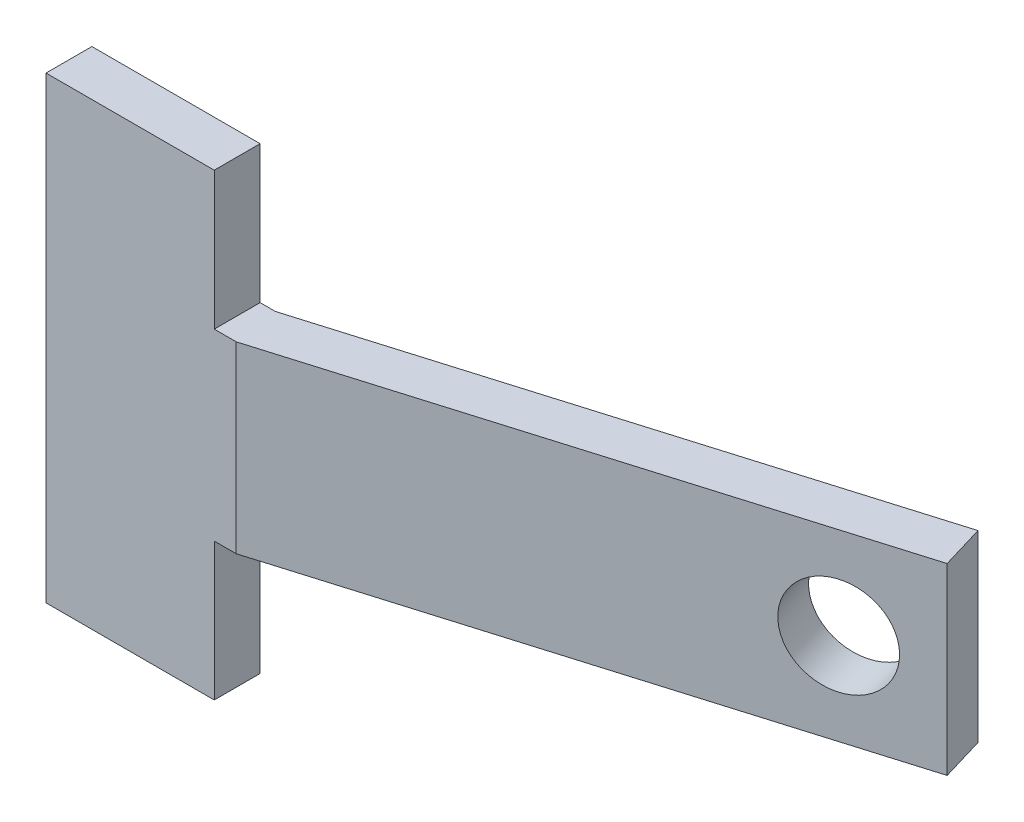
ISO-10303-21;
HEADER;
FILE_DESCRIPTION(('STEP AP214'),'2;1');
FILE_NAME('part.step','',(''),(''),'','','');
FILE_SCHEMA(('AUTOMOTIVE_DESIGN { 1 0 10303 214 1 1 1 1 }'));
ENDSEC;
DATA;
#1=APPLICATION_CONTEXT('core data for automotive mechanical design processes');
#2=APPLICATION_PROTOCOL_DEFINITION('international standard','automotive_design',2000,#1);
#3=PRODUCT_CONTEXT('',#1,'mechanical');
#4=PRODUCT('Part','Part','',(#3));
#5=PRODUCT_RELATED_PRODUCT_CATEGORY('part','',(#4));
#6=PRODUCT_DEFINITION_FORMATION('','',#4);
#7=PRODUCT_DEFINITION_CONTEXT('part definition',#1,'design');
#8=PRODUCT_DEFINITION('design','',#6,#7);
#9=PRODUCT_DEFINITION_SHAPE('','',#8);
#10=(LENGTH_UNIT() NAMED_UNIT(*) SI_UNIT(.MILLI.,.METRE.));
#11=(NAMED_UNIT(*) PLANE_ANGLE_UNIT() SI_UNIT($,.RADIAN.));
#12=(NAMED_UNIT(*) SI_UNIT($,.STERADIAN.) SOLID_ANGLE_UNIT());
#13=UNCERTAINTY_MEASURE_WITH_UNIT(LENGTH_MEASURE(1.E-05),#10,'distance_accuracy_value','');
#14=(GEOMETRIC_REPRESENTATION_CONTEXT(3) GLOBAL_UNCERTAINTY_ASSIGNED_CONTEXT((#13)) GLOBAL_UNIT_ASSIGNED_CONTEXT((#10,
#11,#12)) REPRESENTATION_CONTEXT('',''));
#15=CARTESIAN_POINT('',(0.,0.,0.));
#16=DIRECTION('',(0.,0.,1.));
#17=DIRECTION('',(1.,0.,0.));
#18=AXIS2_PLACEMENT_3D('',#15,#16,#17);
#19=CARTESIAN_POINT('',(-45.1372802270666,6.,45.84));
#20=DIRECTION('',(0.,0.,1.));
#21=DIRECTION('',(1.,0.,0.));
#22=AXIS2_PLACEMENT_3D('',#19,#20,#21);
#23=PLANE('',#22);
#24=DIRECTION('',(-1.,0.,0.));
#25=VECTOR('',#24,1.);
#26=CARTESIAN_POINT('',(-45.1372802270666,0.,45.84));
#27=LINE('',#26,#25);
#28=CARTESIAN_POINT('',(-39.1372802270666,0.,45.84));
#29=VERTEX_POINT('',#28);
#30=CARTESIAN_POINT('',(-39.6372802270666,0.,45.84));
#31=VERTEX_POINT('',#30);
#32=EDGE_CURVE('E179',#29,#31,#27,.T.);
#33=ORIENTED_EDGE('',*,*,#32,.T.);
#34=DIRECTION('',(0.,-1.,0.));
#35=VECTOR('',#34,1.);
#36=CARTESIAN_POINT('',(-39.6372802270666,10.5,45.84));
#37=LINE('',#36,#35);
#38=CARTESIAN_POINT('',(-39.6372802270666,-4.5,45.84));
#39=VERTEX_POINT('',#38);
#40=EDGE_CURVE('E157',#31,#39,#37,.T.);
#41=ORIENTED_EDGE('',*,*,#40,.T.);
#42=DIRECTION('',(-1.,0.,0.));
#43=VECTOR('',#42,1.);
#44=CARTESIAN_POINT('',(-45.1372802270666,-4.5,45.84));
#45=LINE('',#44,#43);
#46=CARTESIAN_POINT('',(-45.1372802270666,-4.5,45.84));
#47=VERTEX_POINT('',#46);
#48=EDGE_CURVE('E143',#39,#47,#45,.T.);
#49=ORIENTED_EDGE('',*,*,#48,.T.);
#50=DIRECTION('',(0.,-1.,0.));
#51=VECTOR('',#50,1.);
#52=CARTESIAN_POINT('',(-45.1372802270666,6.,45.84));
#53=LINE('',#52,#51);
#54=CARTESIAN_POINT('',(-45.1372802270666,10.5,45.84));
#55=VERTEX_POINT('',#54);
#56=EDGE_CURVE('E47',#55,#47,#53,.T.);
#57=ORIENTED_EDGE('',*,*,#56,.F.);
#58=DIRECTION('',(1.,0.,0.));
#59=VECTOR('',#58,1.);
#60=CARTESIAN_POINT('',(-45.1372802270666,10.5,45.84));
#61=LINE('',#60,#59);
#62=CARTESIAN_POINT('',(-39.6372802270666,10.5,45.84));
#63=VERTEX_POINT('',#62);
#64=EDGE_CURVE('E132',#55,#63,#61,.T.);
#65=ORIENTED_EDGE('',*,*,#64,.T.);
#66=CARTESIAN_POINT('',(-39.6372802270666,6.,45.84));
#67=VERTEX_POINT('',#66);
#68=EDGE_CURVE('E149',#63,#67,#37,.T.);
#69=ORIENTED_EDGE('',*,*,#68,.T.);
#70=DIRECTION('',(-1.,0.,0.));
#71=VECTOR('',#70,1.);
#72=CARTESIAN_POINT('',(-45.1372802270666,6.,45.84));
#73=LINE('',#72,#71);
#74=CARTESIAN_POINT('',(-39.1372802270666,6.,45.84));
#75=VERTEX_POINT('',#74);
#76=EDGE_CURVE('E59',#75,#67,#73,.T.);
#77=ORIENTED_EDGE('',*,*,#76,.F.);
#78=DIRECTION('',(0.,-1.,0.));
#79=VECTOR('',#78,1.);
#80=CARTESIAN_POINT('',(-39.1372802270666,6.,45.84));
#81=LINE('',#80,#79);
#82=EDGE_CURVE('E195',#75,#29,#81,.T.);
#83=ORIENTED_EDGE('',*,*,#82,.T.);
#84=EDGE_LOOP('',(#33,#41,#49,#57,#65,#69,#77,#83));
#85=FACE_BOUND('',#84,.T.);
#86=ADVANCED_FACE('F39',(#85),#23,.F.);
#87=CARTESIAN_POINT('',(-45.1372802270666,6.,45.84));
#88=DIRECTION('',(1.,0.,0.));
#89=DIRECTION('',(0.,0.,-1.));
#90=AXIS2_PLACEMENT_3D('',#87,#88,#89);
#91=PLANE('',#90);
#92=ORIENTED_EDGE('',*,*,#56,.T.);
#93=DIRECTION('',(0.,0.,-1.));
#94=VECTOR('',#93,1.);
#95=CARTESIAN_POINT('',(-45.1372802270666,-4.5,47.34));
#96=LINE('',#95,#94);
#97=CARTESIAN_POINT('',(-45.1372802270666,-4.5,47.34));
#98=VERTEX_POINT('',#97);
#99=EDGE_CURVE('E119',#98,#47,#96,.T.);
#100=ORIENTED_EDGE('',*,*,#99,.F.);
#101=DIRECTION('',(0.,-1.,0.));
#102=VECTOR('',#101,1.);
#103=CARTESIAN_POINT('',(-45.1372802270666,6.,47.34));
#104=LINE('',#103,#102);
#105=CARTESIAN_POINT('',(-45.1372802270666,10.5,47.34));
#106=VERTEX_POINT('',#105);
#107=EDGE_CURVE('E113',#106,#98,#104,.T.);
#108=ORIENTED_EDGE('',*,*,#107,.F.);
#109=DIRECTION('',(0.,0.,-1.));
#110=VECTOR('',#109,1.);
#111=CARTESIAN_POINT('',(-45.1372802270666,10.5,47.34));
#112=LINE('',#111,#110);
#113=EDGE_CURVE('E116',#106,#55,#112,.T.);
#114=ORIENTED_EDGE('',*,*,#113,.T.);
#115=EDGE_LOOP('',(#92,#100,#108,#114));
#116=FACE_BOUND('',#115,.T.);
#117=ADVANCED_FACE('F115',(#116),#91,.F.);
#118=CARTESIAN_POINT('',(-45.1372802270666,6.,47.34));
#119=DIRECTION('',(0.,0.,-1.));
#120=DIRECTION('',(-1.,0.,0.));
#121=AXIS2_PLACEMENT_3D('',#118,#119,#120);
#122=PLANE('',#121);
#123=DIRECTION('',(1.,0.,0.));
#124=VECTOR('',#123,1.);
#125=CARTESIAN_POINT('',(-45.1372802270666,6.,47.34));
#126=LINE('',#125,#124);
#127=CARTESIAN_POINT('',(-39.6372802270666,6.,47.34));
#128=VERTEX_POINT('',#127);
#129=CARTESIAN_POINT('',(-38.9181414665424,6.,47.34));
#130=VERTEX_POINT('',#129);
#131=EDGE_CURVE('E182',#128,#130,#126,.T.);
#132=ORIENTED_EDGE('',*,*,#131,.F.);
#133=DIRECTION('',(0.,-1.,0.));
#134=VECTOR('',#133,1.);
#135=CARTESIAN_POINT('',(-39.6372802270666,10.5,47.34));
#136=LINE('',#135,#134);
#137=CARTESIAN_POINT('',(-39.6372802270666,10.5,47.34));
#138=VERTEX_POINT('',#137);
#139=EDGE_CURVE('E140',#138,#128,#136,.T.);
#140=ORIENTED_EDGE('',*,*,#139,.F.);
#141=DIRECTION('',(1.,0.,0.));
#142=VECTOR('',#141,1.);
#143=CARTESIAN_POINT('',(-45.1372802270666,10.5,47.34));
#144=LINE('',#143,#142);
#145=EDGE_CURVE('E130',#106,#138,#144,.T.);
#146=ORIENTED_EDGE('',*,*,#145,.F.);
#147=ORIENTED_EDGE('',*,*,#107,.T.);
#148=DIRECTION('',(-1.,0.,0.));
#149=VECTOR('',#148,1.);
#150=CARTESIAN_POINT('',(-45.1372802270666,-4.5,47.34));
#151=LINE('',#150,#149);
#152=CARTESIAN_POINT('',(-39.6372802270666,-4.5,47.34));
#153=VERTEX_POINT('',#152);
#154=EDGE_CURVE('E135',#153,#98,#151,.T.);
#155=ORIENTED_EDGE('',*,*,#154,.F.);
#156=CARTESIAN_POINT('',(-39.6372802270666,0.,47.34));
#157=VERTEX_POINT('',#156);
#158=EDGE_CURVE('E142',#157,#153,#136,.T.);
#159=ORIENTED_EDGE('',*,*,#158,.F.);
#160=DIRECTION('',(1.,0.,0.));
#161=VECTOR('',#160,1.);
#162=CARTESIAN_POINT('',(-45.1372802270666,0.,47.34));
#163=LINE('',#162,#161);
#164=CARTESIAN_POINT('',(-38.9181414665424,0.,47.34));
#165=VERTEX_POINT('',#164);
#166=EDGE_CURVE('E199',#157,#165,#163,.T.);
#167=ORIENTED_EDGE('',*,*,#166,.T.);
#168=DIRECTION('',(0.,-1.,0.));
#169=VECTOR('',#168,1.);
#170=CARTESIAN_POINT('',(-38.9181414665424,6.,47.34));
#171=LINE('',#170,#169);
#172=EDGE_CURVE('E125',#130,#165,#171,.T.);
#173=ORIENTED_EDGE('',*,*,#172,.F.);
#174=EDGE_LOOP('',(#132,#140,#146,#147,#155,#159,#167,#173));
#175=FACE_BOUND('',#174,.T.);
#176=ADVANCED_FACE('F138',(#175),#122,.F.);
#177=CARTESIAN_POINT('',(-26.4837149805438,6.,43.6276133785459));
#178=DIRECTION('',(-0.28607921935842,0.,-0.958205969638719));
#179=DIRECTION('',(-0.958205969638719,0.,0.28607921935842));
#180=AXIS2_PLACEMENT_3D('',#177,#178,#179);
#181=PLANE('',#180);
#182=CARTESIAN_POINT('',(-23.7528279670738,3.,42.8122876033743));
#183=DIRECTION('',(0.286079219358415,0.,0.95820596963872));
#184=DIRECTION('',(0.95820596963872,0.,-0.286079219358415));
#185=AXIS2_PLACEMENT_3D('',#182,#183,#184);
#186=CIRCLE('',#185,1.59999999999999);
#187=CARTESIAN_POINT('',(-22.2196984156519,3.,42.3545608524009));
#188=VERTEX_POINT('',#187);
#189=EDGE_CURVE('E171',#188,#188,#186,.T.);
#190=ORIENTED_EDGE('',*,*,#189,.F.);
#191=EDGE_LOOP('',(#190));
#192=FACE_BOUND('',#191,.T.);
#193=DIRECTION('',(0.958205969638719,0.,-0.28607921935842));
#194=VECTOR('',#193,1.);
#195=CARTESIAN_POINT('',(-26.4837149805438,0.,43.6276133785459));
#196=LINE('',#195,#194);
#197=CARTESIAN_POINT('',(-21.0219409536031,0.,41.9969618282029));
#198=VERTEX_POINT('',#197);
#199=EDGE_CURVE('E202',#165,#198,#196,.T.);
#200=ORIENTED_EDGE('',*,*,#199,.T.);
#201=DIRECTION('',(0.,-1.,0.));
#202=VECTOR('',#201,1.);
#203=CARTESIAN_POINT('',(-21.0219409536031,6.,41.9969618282029));
#204=LINE('',#203,#202);
#205=CARTESIAN_POINT('',(-21.0219409536031,6.,41.9969618282029));
#206=VERTEX_POINT('',#205);
#207=EDGE_CURVE('E218',#206,#198,#204,.T.);
#208=ORIENTED_EDGE('',*,*,#207,.F.);
#209=DIRECTION('',(0.958205969638716,0.,-0.286079219358429));
#210=VECTOR('',#209,1.);
#211=CARTESIAN_POINT('',(-38.9181414665424,6.,47.34));
#212=LINE('',#211,#210);
#213=EDGE_CURVE('E186',#130,#206,#212,.T.);
#214=ORIENTED_EDGE('',*,*,#213,.F.);
#215=ORIENTED_EDGE('',*,*,#172,.T.);
#216=EDGE_LOOP('',(#200,#208,#214,#215));
#217=FACE_BOUND('',#216,.T.);
#218=ADVANCED_FACE('F245',(#192,#217),#181,.F.);
#219=CARTESIAN_POINT('',(-21.0219409536031,6.,41.9969618282029));
#220=DIRECTION('',(-0.958205969638719,0.,0.286079219358418));
#221=DIRECTION('',(0.286079219358418,0.,0.958205969638719));
#222=AXIS2_PLACEMENT_3D('',#219,#220,#221);
#223=PLANE('',#222);
#224=DIRECTION('',(-0.286079219358418,0.,-0.958205969638719));
#225=VECTOR('',#224,1.);
#226=CARTESIAN_POINT('',(-21.0219409536031,0.,41.9969618282029));
#227=LINE('',#226,#225);
#228=CARTESIAN_POINT('',(-21.4510597826407,0.,40.5596528737448));
#229=VERTEX_POINT('',#228);
#230=EDGE_CURVE('E205',#198,#229,#227,.T.);
#231=ORIENTED_EDGE('',*,*,#230,.T.);
#232=DIRECTION('',(0.,-1.,0.));
#233=VECTOR('',#232,1.);
#234=CARTESIAN_POINT('',(-21.4510597826407,6.,40.5596528737448));
#235=LINE('',#234,#233);
#236=CARTESIAN_POINT('',(-21.4510597826407,6.,40.5596528737448));
#237=VERTEX_POINT('',#236);
#238=EDGE_CURVE('E214',#237,#229,#235,.T.);
#239=ORIENTED_EDGE('',*,*,#238,.F.);
#240=DIRECTION('',(-0.286079219358418,0.,-0.958205969638719));
#241=VECTOR('',#240,1.);
#242=CARTESIAN_POINT('',(-21.0219409536031,6.,41.9969618282029));
#243=LINE('',#242,#241);
#244=EDGE_CURVE('E189',#206,#237,#243,.T.);
#245=ORIENTED_EDGE('',*,*,#244,.F.);
#246=ORIENTED_EDGE('',*,*,#207,.T.);
#247=EDGE_LOOP('',(#231,#239,#245,#246));
#248=FACE_BOUND('',#247,.T.);
#249=ADVANCED_FACE('F254',(#248),#223,.F.);
#250=CARTESIAN_POINT('',(-27.200295600473,6.,42.2761281898953));
#251=DIRECTION('',(0.286079219358428,0.,0.958205969638716));
#252=DIRECTION('',(0.958205969638716,0.,-0.286079219358428));
#253=AXIS2_PLACEMENT_3D('',#250,#251,#252);
#254=PLANE('',#253);
#255=CARTESIAN_POINT('',(-24.1819467961114,3.,41.3749786489164));
#256=DIRECTION('',(0.286079219358428,0.,0.958205969638716));
#257=DIRECTION('',(0.958205969638716,0.,-0.286079219358428));
#258=AXIS2_PLACEMENT_3D('',#255,#256,#257);
#259=CIRCLE('',#258,1.59999999999999);
#260=CARTESIAN_POINT('',(-22.6488172446894,3.,40.9172518979429));
#261=VERTEX_POINT('',#260);
#262=EDGE_CURVE('E175',#261,#261,#259,.T.);
#263=ORIENTED_EDGE('',*,*,#262,.T.);
#264=EDGE_LOOP('',(#263));
#265=FACE_BOUND('',#264,.T.);
#266=DIRECTION('',(-0.958205969638716,0.,0.286079219358428));
#267=VECTOR('',#266,1.);
#268=CARTESIAN_POINT('',(-27.200295600473,0.,42.2761281898953));
#269=LINE('',#268,#267);
#270=EDGE_CURVE('E183',#229,#29,#269,.T.);
#271=ORIENTED_EDGE('',*,*,#270,.T.);
#272=ORIENTED_EDGE('',*,*,#82,.F.);
#273=DIRECTION('',(-0.958205969638719,0.,0.28607921935842));
#274=VECTOR('',#273,1.);
#275=CARTESIAN_POINT('',(-21.4510597826407,6.,40.5596528737448));
#276=LINE('',#275,#274);
#277=EDGE_CURVE('E192',#237,#75,#276,.T.);
#278=ORIENTED_EDGE('',*,*,#277,.F.);
#279=ORIENTED_EDGE('',*,*,#238,.T.);
#280=EDGE_LOOP('',(#271,#272,#278,#279));
#281=FACE_BOUND('',#280,.T.);
#282=ADVANCED_FACE('F256',(#265,#281),#254,.F.);
#283=CARTESIAN_POINT('',(0.,6.,0.));
#284=DIRECTION('',(0.,-1.,0.));
#285=DIRECTION('',(0.,0.,-1.));
#286=AXIS2_PLACEMENT_3D('',#283,#284,#285);
#287=PLANE('',#286);
#288=ORIENTED_EDGE('',*,*,#76,.T.);
#289=DIRECTION('',(0.,0.,1.));
#290=VECTOR('',#289,1.);
#291=CARTESIAN_POINT('',(-39.6372802270666,6.,0.));
#292=LINE('',#291,#290);
#293=EDGE_CURVE('E54',#67,#128,#292,.T.);
#294=ORIENTED_EDGE('',*,*,#293,.T.);
#295=ORIENTED_EDGE('',*,*,#131,.T.);
#296=ORIENTED_EDGE('',*,*,#213,.T.);
#297=ORIENTED_EDGE('',*,*,#244,.T.);
#298=ORIENTED_EDGE('',*,*,#277,.T.);
#299=EDGE_LOOP('',(#288,#294,#295,#296,#297,#298));
#300=FACE_BOUND('',#299,.T.);
#301=ADVANCED_FACE('F257',(#300),#287,.F.);
#302=CARTESIAN_POINT('',(0.,0.,0.));
#303=DIRECTION('',(0.,-1.,0.));
#304=DIRECTION('',(0.,0.,-1.));
#305=AXIS2_PLACEMENT_3D('',#302,#303,#304);
#306=PLANE('',#305);
#307=DIRECTION('',(0.,0.,1.));
#308=VECTOR('',#307,1.);
#309=CARTESIAN_POINT('',(-39.6372802270666,0.,0.));
#310=LINE('',#309,#308);
#311=EDGE_CURVE('E11',#31,#157,#310,.T.);
#312=ORIENTED_EDGE('',*,*,#311,.F.);
#313=ORIENTED_EDGE('',*,*,#32,.F.);
#314=ORIENTED_EDGE('',*,*,#270,.F.);
#315=ORIENTED_EDGE('',*,*,#230,.F.);
#316=ORIENTED_EDGE('',*,*,#199,.F.);
#317=ORIENTED_EDGE('',*,*,#166,.F.);
#318=EDGE_LOOP('',(#312,#313,#314,#315,#316,#317));
#319=FACE_BOUND('',#318,.T.);
#320=ADVANCED_FACE('F240',(#319),#306,.T.);
#321=CARTESIAN_POINT('',(-23.7528279670738,3.,42.8122876033743));
#322=DIRECTION('',(0.286079219358415,0.,0.95820596963872));
#323=DIRECTION('',(0.95820596963872,0.,-0.286079219358415));
#324=AXIS2_PLACEMENT_3D('',#321,#322,#323);
#325=CYLINDRICAL_SURFACE('',#324,1.59999999999999);
#326=ORIENTED_EDGE('',*,*,#189,.T.);
#327=EDGE_LOOP('',(#326));
#328=FACE_BOUND('',#327,.T.);
#329=ORIENTED_EDGE('',*,*,#262,.F.);
#330=EDGE_LOOP('',(#329));
#331=FACE_BOUND('',#330,.T.);
#332=ADVANCED_FACE('F264',(#328,#331),#325,.F.);
#333=CARTESIAN_POINT('',(-45.1372802270666,-4.5,47.34));
#334=DIRECTION('',(0.,-1.,0.));
#335=DIRECTION('',(0.,0.,-1.));
#336=AXIS2_PLACEMENT_3D('',#333,#334,#335);
#337=PLANE('',#336);
#338=ORIENTED_EDGE('',*,*,#48,.F.);
#339=DIRECTION('',(0.,0.,-1.));
#340=VECTOR('',#339,1.);
#341=CARTESIAN_POINT('',(-39.6372802270666,-4.5,47.34));
#342=LINE('',#341,#340);
#343=EDGE_CURVE('E163',#153,#39,#342,.T.);
#344=ORIENTED_EDGE('',*,*,#343,.F.);
#345=ORIENTED_EDGE('',*,*,#154,.T.);
#346=ORIENTED_EDGE('',*,*,#99,.T.);
#347=EDGE_LOOP('',(#338,#344,#345,#346));
#348=FACE_BOUND('',#347,.T.);
#349=ADVANCED_FACE('F228',(#348),#337,.T.);
#350=CARTESIAN_POINT('',(-39.6372802270666,10.5,47.34));
#351=DIRECTION('',(1.,0.,0.));
#352=DIRECTION('',(0.,0.,-1.));
#353=AXIS2_PLACEMENT_3D('',#350,#351,#352);
#354=PLANE('',#353);
#355=ORIENTED_EDGE('',*,*,#40,.F.);
#356=ORIENTED_EDGE('',*,*,#311,.T.);
#357=ORIENTED_EDGE('',*,*,#158,.T.);
#358=ORIENTED_EDGE('',*,*,#343,.T.);
#359=EDGE_LOOP('',(#355,#356,#357,#358));
#360=FACE_BOUND('',#359,.T.);
#361=ADVANCED_FACE('F234',(#360),#354,.T.);
#362=ORIENTED_EDGE('',*,*,#293,.F.);
#363=ORIENTED_EDGE('',*,*,#68,.F.);
#364=DIRECTION('',(0.,0.,-1.));
#365=VECTOR('',#364,1.);
#366=CARTESIAN_POINT('',(-39.6372802270666,10.5,47.34));
#367=LINE('',#366,#365);
#368=EDGE_CURVE('E134',#138,#63,#367,.T.);
#369=ORIENTED_EDGE('',*,*,#368,.F.);
#370=ORIENTED_EDGE('',*,*,#139,.T.);
#371=EDGE_LOOP('',(#362,#363,#369,#370));
#372=FACE_BOUND('',#371,.T.);
#373=ADVANCED_FACE('F247',(#372),#354,.T.);
#374=CARTESIAN_POINT('',(-45.1372802270666,10.5,47.34));
#375=DIRECTION('',(0.,1.,0.));
#376=DIRECTION('',(0.,0.,1.));
#377=AXIS2_PLACEMENT_3D('',#374,#375,#376);
#378=PLANE('',#377);
#379=ORIENTED_EDGE('',*,*,#64,.F.);
#380=ORIENTED_EDGE('',*,*,#113,.F.);
#381=ORIENTED_EDGE('',*,*,#145,.T.);
#382=ORIENTED_EDGE('',*,*,#368,.T.);
#383=EDGE_LOOP('',(#379,#380,#381,#382));
#384=FACE_BOUND('',#383,.T.);
#385=ADVANCED_FACE('F129',(#384),#378,.T.);
#386=CLOSED_SHELL('',(#86,#117,#176,#218,#249,#282,#301,#320,#332,#349,#361,#373,#385));
#387=MANIFOLD_SOLID_BREP('B2',#386);
#388=ADVANCED_BREP_SHAPE_REPRESENTATION('',(#18,#387),#14);
#389=SHAPE_DEFINITION_REPRESENTATION(#9,#388);
ENDSEC;
END-ISO-10303-21;
